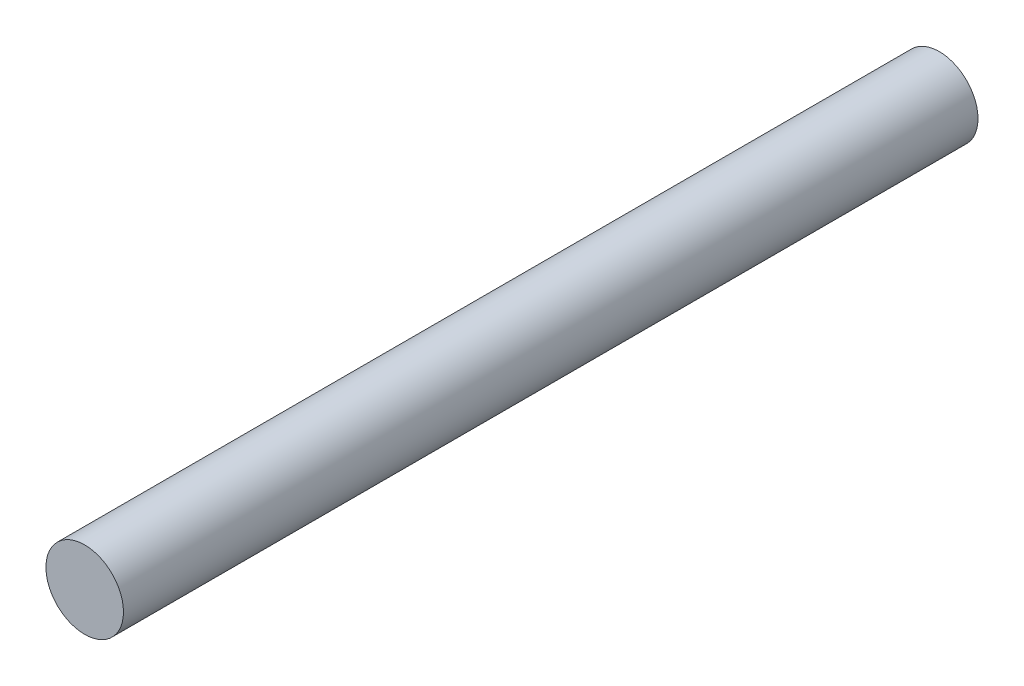
ISO-10303-21;
HEADER;
FILE_DESCRIPTION(('STEP AP214'),'2;1');
FILE_NAME('part.step','',(''),(''),'','','');
FILE_SCHEMA(('AUTOMOTIVE_DESIGN { 1 0 10303 214 1 1 1 1 }'));
ENDSEC;
DATA;
#1=APPLICATION_CONTEXT('core data for automotive mechanical design processes');
#2=APPLICATION_PROTOCOL_DEFINITION('international standard','automotive_design',2000,#1);
#3=PRODUCT_CONTEXT('',#1,'mechanical');
#4=PRODUCT('Part','Part','',(#3));
#5=PRODUCT_RELATED_PRODUCT_CATEGORY('part','',(#4));
#6=PRODUCT_DEFINITION_FORMATION('','',#4);
#7=PRODUCT_DEFINITION_CONTEXT('part definition',#1,'design');
#8=PRODUCT_DEFINITION('design','',#6,#7);
#9=PRODUCT_DEFINITION_SHAPE('','',#8);
#10=(LENGTH_UNIT() NAMED_UNIT(*) SI_UNIT(.MILLI.,.METRE.));
#11=(NAMED_UNIT(*) PLANE_ANGLE_UNIT() SI_UNIT($,.RADIAN.));
#12=(NAMED_UNIT(*) SI_UNIT($,.STERADIAN.) SOLID_ANGLE_UNIT());
#13=UNCERTAINTY_MEASURE_WITH_UNIT(LENGTH_MEASURE(1.E-05),#10,'distance_accuracy_value','');
#14=(GEOMETRIC_REPRESENTATION_CONTEXT(3) GLOBAL_UNCERTAINTY_ASSIGNED_CONTEXT((#13)) GLOBAL_UNIT_ASSIGNED_CONTEXT((#10,
#11,#12)) REPRESENTATION_CONTEXT('',''));
#15=CARTESIAN_POINT('',(0.,0.,0.));
#16=DIRECTION('',(0.,0.,1.));
#17=DIRECTION('',(1.,0.,0.));
#18=AXIS2_PLACEMENT_3D('',#15,#16,#17);
#19=CARTESIAN_POINT('',(0.,0.,5.51));
#20=DIRECTION('',(0.,0.,-1.));
#21=DIRECTION('',(-1.,0.,0.));
#22=AXIS2_PLACEMENT_3D('',#19,#20,#21);
#23=CYLINDRICAL_SURFACE('',#22,0.5);
#24=CARTESIAN_POINT('',(0.,0.,5.51));
#25=DIRECTION('',(0.,0.,1.));
#26=DIRECTION('',(1.,0.,0.));
#27=AXIS2_PLACEMENT_3D('',#24,#25,#26);
#28=CIRCLE('',#27,0.5);
#29=CARTESIAN_POINT('',(0.5,0.,5.51));
#30=VERTEX_POINT('',#29);
#31=EDGE_CURVE('E10',#30,#30,#28,.T.);
#32=ORIENTED_EDGE('',*,*,#31,.F.);
#33=EDGE_LOOP('',(#32));
#34=FACE_BOUND('',#33,.T.);
#35=CARTESIAN_POINT('',(0.,0.,-5.51));
#36=DIRECTION('',(0.,0.,1.));
#37=DIRECTION('',(1.,0.,0.));
#38=AXIS2_PLACEMENT_3D('',#35,#36,#37);
#39=CIRCLE('',#38,0.5);
#40=CARTESIAN_POINT('',(0.5,0.,-5.51));
#41=VERTEX_POINT('',#40);
#42=EDGE_CURVE('E44',#41,#41,#39,.T.);
#43=ORIENTED_EDGE('',*,*,#42,.T.);
#44=EDGE_LOOP('',(#43));
#45=FACE_BOUND('',#44,.T.);
#46=ADVANCED_FACE('F41',(#34,#45),#23,.T.);
#47=CARTESIAN_POINT('',(0.,0.,5.51));
#48=DIRECTION('',(0.,0.,1.));
#49=DIRECTION('',(1.,0.,0.));
#50=AXIS2_PLACEMENT_3D('',#47,#48,#49);
#51=PLANE('',#50);
#52=ORIENTED_EDGE('',*,*,#31,.T.);
#53=EDGE_LOOP('',(#52));
#54=FACE_BOUND('',#53,.T.);
#55=ADVANCED_FACE('F58',(#54),#51,.T.);
#56=CARTESIAN_POINT('',(0.,0.,-5.51));
#57=DIRECTION('',(0.,0.,1.));
#58=DIRECTION('',(1.,0.,0.));
#59=AXIS2_PLACEMENT_3D('',#56,#57,#58);
#60=PLANE('',#59);
#61=ORIENTED_EDGE('',*,*,#42,.F.);
#62=EDGE_LOOP('',(#61));
#63=FACE_BOUND('',#62,.T.);
#64=ADVANCED_FACE('F56',(#63),#60,.F.);
#65=CLOSED_SHELL('',(#46,#55,#64));
#66=MANIFOLD_SOLID_BREP('B2',#65);
#67=ADVANCED_BREP_SHAPE_REPRESENTATION('',(#18,#66),#14);
#68=SHAPE_DEFINITION_REPRESENTATION(#9,#67);
ENDSEC;
END-ISO-10303-21;
